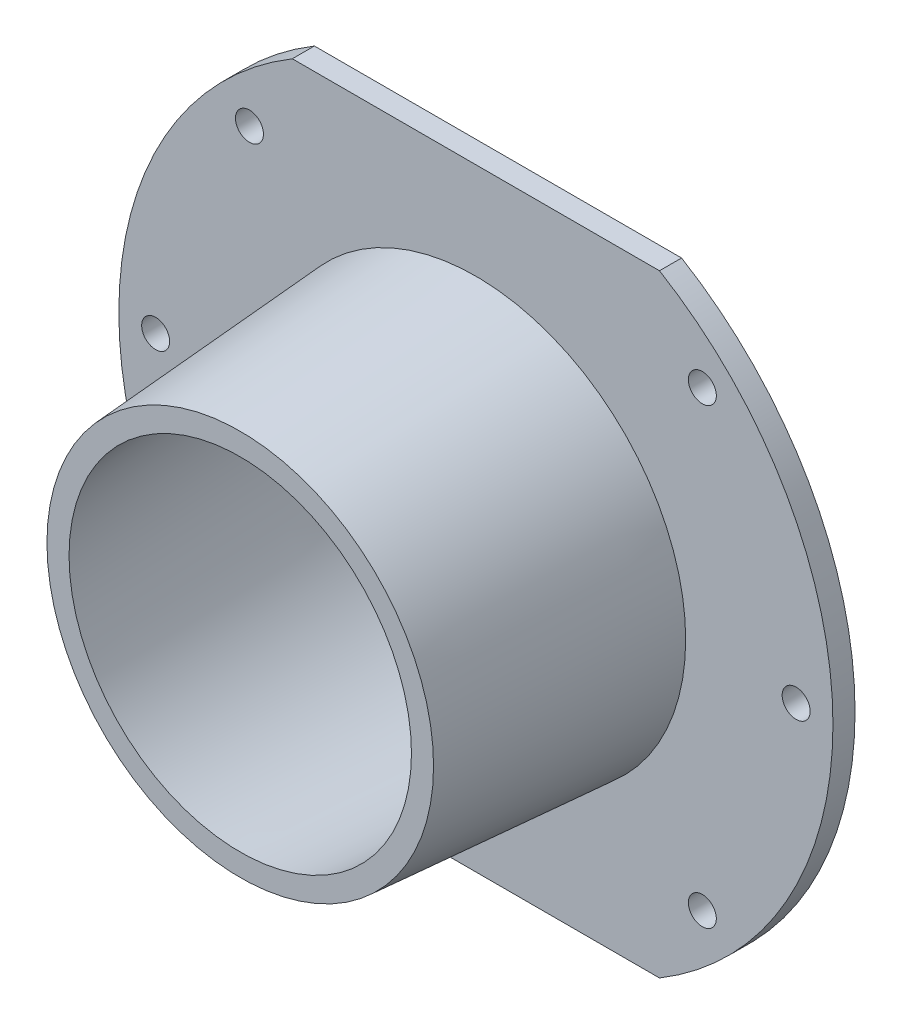
ISO-10303-21;
HEADER;
FILE_DESCRIPTION(('STEP AP214'),'2;1');
FILE_NAME('part.step','',(''),(''),'','','');
FILE_SCHEMA(('AUTOMOTIVE_DESIGN { 1 0 10303 214 1 1 1 1 }'));
ENDSEC;
DATA;
#1=APPLICATION_CONTEXT('core data for automotive mechanical design processes');
#2=APPLICATION_PROTOCOL_DEFINITION('international standard','automotive_design',2000,#1);
#3=PRODUCT_CONTEXT('',#1,'mechanical');
#4=PRODUCT('Part','Part','',(#3));
#5=PRODUCT_RELATED_PRODUCT_CATEGORY('part','',(#4));
#6=PRODUCT_DEFINITION_FORMATION('','',#4);
#7=PRODUCT_DEFINITION_CONTEXT('part definition',#1,'design');
#8=PRODUCT_DEFINITION('design','',#6,#7);
#9=PRODUCT_DEFINITION_SHAPE('','',#8);
#10=(LENGTH_UNIT() NAMED_UNIT(*) SI_UNIT(.MILLI.,.METRE.));
#11=(NAMED_UNIT(*) PLANE_ANGLE_UNIT() SI_UNIT($,.RADIAN.));
#12=(NAMED_UNIT(*) SI_UNIT($,.STERADIAN.) SOLID_ANGLE_UNIT());
#13=UNCERTAINTY_MEASURE_WITH_UNIT(LENGTH_MEASURE(1.E-05),#10,'distance_accuracy_value','');
#14=(GEOMETRIC_REPRESENTATION_CONTEXT(3) GLOBAL_UNCERTAINTY_ASSIGNED_CONTEXT((#13)) GLOBAL_UNIT_ASSIGNED_CONTEXT((#10,
#11,#12)) REPRESENTATION_CONTEXT('',''));
#15=CARTESIAN_POINT('',(0.,0.,0.));
#16=DIRECTION('',(0.,0.,1.));
#17=DIRECTION('',(1.,0.,0.));
#18=AXIS2_PLACEMENT_3D('',#15,#16,#17);
#19=CARTESIAN_POINT('',(0.,0.,-35.));
#20=DIRECTION('',(0.,0.,1.));
#21=DIRECTION('',(1.,0.,0.));
#22=AXIS2_PLACEMENT_3D('',#19,#20,#21);
#23=PLANE('',#22);
#24=CARTESIAN_POINT('',(-30.7504178571297,-30.7504178571293,-35.));
#25=DIRECTION('',(0.,0.,1.));
#26=DIRECTION('',(-0.707106781186551,-0.707106781186544,0.));
#27=AXIS2_PLACEMENT_3D('',#24,#25,#26);
#28=CIRCLE('',#27,1.9);
#29=CARTESIAN_POINT('',(-32.0939207413841,-32.0939207413838,-35.));
#30=VERTEX_POINT('',#29);
#31=EDGE_CURVE('E123',#30,#30,#28,.T.);
#32=ORIENTED_EDGE('',*,*,#31,.T.);
#33=EDGE_LOOP('',(#32));
#34=FACE_BOUND('',#33,.T.);
#35=CARTESIAN_POINT('',(-43.4876579821923,0.,-35.));
#36=DIRECTION('',(0.,0.,1.));
#37=DIRECTION('',(-1.,0.,0.));
#38=AXIS2_PLACEMENT_3D('',#35,#36,#37);
#39=CIRCLE('',#38,1.9);
#40=CARTESIAN_POINT('',(-45.3876579821923,0.,-35.));
#41=VERTEX_POINT('',#40);
#42=EDGE_CURVE('E130',#41,#41,#39,.T.);
#43=ORIENTED_EDGE('',*,*,#42,.T.);
#44=EDGE_LOOP('',(#43));
#45=FACE_BOUND('',#44,.T.);
#46=CARTESIAN_POINT('',(-30.7504178571292,30.7504178571298,-35.));
#47=DIRECTION('',(0.,0.,1.));
#48=DIRECTION('',(-0.707106781186541,0.707106781186554,0.));
#49=AXIS2_PLACEMENT_3D('',#46,#47,#48);
#50=CIRCLE('',#49,1.9);
#51=CARTESIAN_POINT('',(-32.0939207413837,32.0939207413842,-35.));
#52=VERTEX_POINT('',#51);
#53=EDGE_CURVE('E136',#52,#52,#50,.T.);
#54=ORIENTED_EDGE('',*,*,#53,.T.);
#55=EDGE_LOOP('',(#54));
#56=FACE_BOUND('',#55,.T.);
#57=CARTESIAN_POINT('',(30.7504178571299,30.7504178571291,-35.));
#58=DIRECTION('',(0.,0.,1.));
#59=DIRECTION('',(0.707106781186556,0.707106781186539,0.));
#60=AXIS2_PLACEMENT_3D('',#57,#58,#59);
#61=CIRCLE('',#60,1.9);
#62=CARTESIAN_POINT('',(32.0939207413843,32.0939207413835,-35.));
#63=VERTEX_POINT('',#62);
#64=EDGE_CURVE('E117',#63,#63,#61,.T.);
#65=ORIENTED_EDGE('',*,*,#64,.T.);
#66=EDGE_LOOP('',(#65));
#67=FACE_BOUND('',#66,.T.);
#68=CARTESIAN_POINT('',(30.7504178571294,-30.7504178571296,-35.));
#69=DIRECTION('',(0.,0.,1.));
#70=DIRECTION('',(0.707106781186546,-0.707106781186549,0.));
#71=AXIS2_PLACEMENT_3D('',#68,#69,#70);
#72=CIRCLE('',#71,1.9);
#73=CARTESIAN_POINT('',(32.0939207413839,-32.093920741384,-35.));
#74=VERTEX_POINT('',#73);
#75=EDGE_CURVE('E141',#74,#74,#72,.T.);
#76=ORIENTED_EDGE('',*,*,#75,.T.);
#77=EDGE_LOOP('',(#76));
#78=FACE_BOUND('',#77,.T.);
#79=CARTESIAN_POINT('',(43.4876579821923,0.,-35.));
#80=DIRECTION('',(0.,0.,1.));
#81=DIRECTION('',(1.,0.,0.));
#82=AXIS2_PLACEMENT_3D('',#79,#80,#81);
#83=CIRCLE('',#82,1.9);
#84=CARTESIAN_POINT('',(45.3876579821923,0.,-35.));
#85=VERTEX_POINT('',#84);
#86=EDGE_CURVE('E147',#85,#85,#83,.T.);
#87=ORIENTED_EDGE('',*,*,#86,.T.);
#88=EDGE_LOOP('',(#87));
#89=FACE_BOUND('',#88,.T.);
#90=CARTESIAN_POINT('',(0.,0.,-35.));
#91=DIRECTION('',(0.,0.,1.));
#92=DIRECTION('',(1.,0.,0.));
#93=AXIS2_PLACEMENT_3D('',#90,#91,#92);
#94=CIRCLE('',#93,25.6974384180229);
#95=CARTESIAN_POINT('',(25.6974384180229,0.,-35.));
#96=VERTEX_POINT('',#95);
#97=EDGE_CURVE('E157',#96,#96,#94,.T.);
#98=ORIENTED_EDGE('',*,*,#97,.T.);
#99=EDGE_LOOP('',(#98));
#100=FACE_BOUND('',#99,.T.);
#101=DIRECTION('',(1.,0.,0.));
#102=VECTOR('',#101,1.);
#103=CARTESIAN_POINT('',(-48.4876579821923,-41.5876579821923,-35.));
#104=LINE('',#103,#102);
#105=CARTESIAN_POINT('',(-24.9302964313354,-41.5876579821923,-35.));
#106=VERTEX_POINT('',#105);
#107=CARTESIAN_POINT('',(24.9302964313354,-41.5876579821923,-35.));
#108=VERTEX_POINT('',#107);
#109=EDGE_CURVE('E107',#106,#108,#104,.T.);
#110=ORIENTED_EDGE('',*,*,#109,.F.);
#111=CARTESIAN_POINT('',(0.,0.,-35.));
#112=DIRECTION('',(0.,0.,1.));
#113=DIRECTION('',(1.,0.,0.));
#114=AXIS2_PLACEMENT_3D('',#111,#112,#113);
#115=CIRCLE('',#114,48.4876579821923);
#116=CARTESIAN_POINT('',(-24.9302964313354,41.5876579821923,-35.));
#117=VERTEX_POINT('',#116);
#118=EDGE_CURVE('E106',#117,#106,#115,.T.);
#119=ORIENTED_EDGE('',*,*,#118,.F.);
#120=DIRECTION('',(-1.,0.,0.));
#121=VECTOR('',#120,1.);
#122=CARTESIAN_POINT('',(-48.4876579821923,41.5876579821923,-35.));
#123=LINE('',#122,#121);
#124=CARTESIAN_POINT('',(24.9302964313354,41.5876579821923,-35.));
#125=VERTEX_POINT('',#124);
#126=EDGE_CURVE('E58',#125,#117,#123,.T.);
#127=ORIENTED_EDGE('',*,*,#126,.F.);
#128=EDGE_CURVE('E154',#108,#125,#115,.T.);
#129=ORIENTED_EDGE('',*,*,#128,.F.);
#130=EDGE_LOOP('',(#110,#119,#127,#129));
#131=FACE_BOUND('',#130,.T.);
#132=ADVANCED_FACE('F43',(#34,#45,#56,#67,#78,#89,#100,#131),#23,.F.);
#133=CARTESIAN_POINT('',(0.,0.,0.));
#134=DIRECTION('',(0.,0.,1.));
#135=DIRECTION('',(1.,0.,0.));
#136=AXIS2_PLACEMENT_3D('',#133,#134,#135);
#137=CYLINDRICAL_SURFACE('',#136,48.4876579821923);
#138=DIRECTION('',(0.,0.,1.));
#139=VECTOR('',#138,1.);
#140=CARTESIAN_POINT('',(24.9302964313354,-41.5876579821923,0.));
#141=LINE('',#140,#139);
#142=CARTESIAN_POINT('',(24.9302964313354,-41.5876579821923,-32.));
#143=VERTEX_POINT('',#142);
#144=EDGE_CURVE('E102',#108,#143,#141,.T.);
#145=ORIENTED_EDGE('',*,*,#144,.F.);
#146=ORIENTED_EDGE('',*,*,#128,.T.);
#147=DIRECTION('',(0.,0.,1.));
#148=VECTOR('',#147,1.);
#149=CARTESIAN_POINT('',(24.9302964313354,41.5876579821923,0.));
#150=LINE('',#149,#148);
#151=CARTESIAN_POINT('',(24.9302964313354,41.5876579821923,-32.));
#152=VERTEX_POINT('',#151);
#153=EDGE_CURVE('E63',#152,#125,#150,.F.);
#154=ORIENTED_EDGE('',*,*,#153,.F.);
#155=CARTESIAN_POINT('',(0.,0.,-32.));
#156=DIRECTION('',(0.,0.,1.));
#157=DIRECTION('',(1.,0.,0.));
#158=AXIS2_PLACEMENT_3D('',#155,#156,#157);
#159=CIRCLE('',#158,48.4876579821923);
#160=EDGE_CURVE('E91',#143,#152,#159,.T.);
#161=ORIENTED_EDGE('',*,*,#160,.F.);
#162=EDGE_LOOP('',(#145,#146,#154,#161));
#163=FACE_BOUND('',#162,.T.);
#164=ADVANCED_FACE('F179',(#163),#137,.T.);
#165=ORIENTED_EDGE('',*,*,#118,.T.);
#166=DIRECTION('',(0.,0.,1.));
#167=VECTOR('',#166,1.);
#168=CARTESIAN_POINT('',(-24.9302964313354,-41.5876579821923,0.));
#169=LINE('',#168,#167);
#170=CARTESIAN_POINT('',(-24.9302964313354,-41.5876579821923,-32.));
#171=VERTEX_POINT('',#170);
#172=EDGE_CURVE('E99',#171,#106,#169,.F.);
#173=ORIENTED_EDGE('',*,*,#172,.F.);
#174=CARTESIAN_POINT('',(-24.9302964313354,41.5876579821923,-32.));
#175=VERTEX_POINT('',#174);
#176=EDGE_CURVE('E83',#175,#171,#159,.T.);
#177=ORIENTED_EDGE('',*,*,#176,.F.);
#178=DIRECTION('',(0.,0.,1.));
#179=VECTOR('',#178,1.);
#180=CARTESIAN_POINT('',(-24.9302964313354,41.5876579821923,0.));
#181=LINE('',#180,#179);
#182=EDGE_CURVE('E114',#117,#175,#181,.T.);
#183=ORIENTED_EDGE('',*,*,#182,.F.);
#184=EDGE_LOOP('',(#165,#173,#177,#183));
#185=FACE_BOUND('',#184,.T.);
#186=ADVANCED_FACE('F104',(#185),#137,.T.);
#187=CARTESIAN_POINT('',(0.,0.,-32.));
#188=DIRECTION('',(0.,0.,-1.));
#189=DIRECTION('',(-1.,0.,0.));
#190=AXIS2_PLACEMENT_3D('',#187,#188,#189);
#191=PLANE('',#190);
#192=CARTESIAN_POINT('',(-30.7504178571297,-30.7504178571293,-32.));
#193=DIRECTION('',(0.,0.,1.));
#194=DIRECTION('',(-0.707106781186551,-0.707106781186544,0.));
#195=AXIS2_PLACEMENT_3D('',#192,#193,#194);
#196=CIRCLE('',#195,1.9);
#197=CARTESIAN_POINT('',(-32.0939207413841,-32.0939207413838,-32.));
#198=VERTEX_POINT('',#197);
#199=EDGE_CURVE('E127',#198,#198,#196,.T.);
#200=ORIENTED_EDGE('',*,*,#199,.F.);
#201=EDGE_LOOP('',(#200));
#202=FACE_BOUND('',#201,.T.);
#203=CARTESIAN_POINT('',(-43.4876579821923,0.,-32.));
#204=DIRECTION('',(0.,0.,1.));
#205=DIRECTION('',(-1.,0.,0.));
#206=AXIS2_PLACEMENT_3D('',#203,#204,#205);
#207=CIRCLE('',#206,1.9);
#208=CARTESIAN_POINT('',(-45.3876579821923,0.,-32.));
#209=VERTEX_POINT('',#208);
#210=EDGE_CURVE('E133',#209,#209,#207,.T.);
#211=ORIENTED_EDGE('',*,*,#210,.F.);
#212=EDGE_LOOP('',(#211));
#213=FACE_BOUND('',#212,.T.);
#214=CARTESIAN_POINT('',(-30.7504178571292,30.7504178571298,-32.));
#215=DIRECTION('',(0.,0.,1.));
#216=DIRECTION('',(-0.707106781186541,0.707106781186554,0.));
#217=AXIS2_PLACEMENT_3D('',#214,#215,#216);
#218=CIRCLE('',#217,1.9);
#219=CARTESIAN_POINT('',(-32.0939207413837,32.0939207413842,-32.));
#220=VERTEX_POINT('',#219);
#221=EDGE_CURVE('E120',#220,#220,#218,.T.);
#222=ORIENTED_EDGE('',*,*,#221,.F.);
#223=EDGE_LOOP('',(#222));
#224=FACE_BOUND('',#223,.T.);
#225=CARTESIAN_POINT('',(30.7504178571299,30.7504178571291,-32.));
#226=DIRECTION('',(0.,0.,1.));
#227=DIRECTION('',(0.707106781186556,0.707106781186539,0.));
#228=AXIS2_PLACEMENT_3D('',#225,#226,#227);
#229=CIRCLE('',#228,1.9);
#230=CARTESIAN_POINT('',(32.0939207413843,32.0939207413835,-32.));
#231=VERTEX_POINT('',#230);
#232=EDGE_CURVE('E116',#231,#231,#229,.T.);
#233=ORIENTED_EDGE('',*,*,#232,.F.);
#234=EDGE_LOOP('',(#233));
#235=FACE_BOUND('',#234,.T.);
#236=CARTESIAN_POINT('',(30.7504178571294,-30.7504178571296,-32.));
#237=DIRECTION('',(0.,0.,1.));
#238=DIRECTION('',(0.707106781186546,-0.707106781186549,0.));
#239=AXIS2_PLACEMENT_3D('',#236,#237,#238);
#240=CIRCLE('',#239,1.9);
#241=CARTESIAN_POINT('',(32.0939207413839,-32.093920741384,-32.));
#242=VERTEX_POINT('',#241);
#243=EDGE_CURVE('E126',#242,#242,#240,.T.);
#244=ORIENTED_EDGE('',*,*,#243,.F.);
#245=EDGE_LOOP('',(#244));
#246=FACE_BOUND('',#245,.T.);
#247=CARTESIAN_POINT('',(43.4876579821923,0.,-32.));
#248=DIRECTION('',(0.,0.,1.));
#249=DIRECTION('',(1.,0.,0.));
#250=AXIS2_PLACEMENT_3D('',#247,#248,#249);
#251=CIRCLE('',#250,1.9);
#252=CARTESIAN_POINT('',(45.3876579821923,0.,-32.));
#253=VERTEX_POINT('',#252);
#254=EDGE_CURVE('E144',#253,#253,#251,.T.);
#255=ORIENTED_EDGE('',*,*,#254,.F.);
#256=EDGE_LOOP('',(#255));
#257=FACE_BOUND('',#256,.T.);
#258=CARTESIAN_POINT('',(0.,0.,-32.));
#259=DIRECTION('',(0.,0.,1.));
#260=DIRECTION('',(1.,0.,0.));
#261=AXIS2_PLACEMENT_3D('',#258,#259,#260);
#262=CIRCLE('',#261,28.4876579821923);
#263=CARTESIAN_POINT('',(28.4876579821923,0.,-32.));
#264=VERTEX_POINT('',#263);
#265=EDGE_CURVE('E92',#264,#264,#262,.T.);
#266=ORIENTED_EDGE('',*,*,#265,.F.);
#267=EDGE_LOOP('',(#266));
#268=FACE_BOUND('',#267,.T.);
#269=DIRECTION('',(1.,0.,0.));
#270=VECTOR('',#269,1.);
#271=CARTESIAN_POINT('',(-48.4876579821923,-41.5876579821923,-32.));
#272=LINE('',#271,#270);
#273=EDGE_CURVE('E87',#171,#143,#272,.T.);
#274=ORIENTED_EDGE('',*,*,#273,.T.);
#275=ORIENTED_EDGE('',*,*,#160,.T.);
#276=DIRECTION('',(-1.,0.,0.));
#277=VECTOR('',#276,1.);
#278=CARTESIAN_POINT('',(-48.4876579821923,41.5876579821923,-32.));
#279=LINE('',#278,#277);
#280=EDGE_CURVE('E88',#152,#175,#279,.T.);
#281=ORIENTED_EDGE('',*,*,#280,.T.);
#282=ORIENTED_EDGE('',*,*,#176,.T.);
#283=EDGE_LOOP('',(#274,#275,#281,#282));
#284=FACE_BOUND('',#283,.T.);
#285=ADVANCED_FACE('F85',(#202,#213,#224,#235,#246,#257,#268,#284),#191,.F.);
#286=CARTESIAN_POINT('',(0.,0.,-32.));
#287=DIRECTION('',(0.,0.,-1.));
#288=DIRECTION('',(-1.,0.,0.));
#289=AXIS2_PLACEMENT_3D('',#286,#287,#288);
#290=CONICAL_SURFACE('',#289,28.4876579821923,0.0698131700797738);
#291=CARTESIAN_POINT('',(0.,0.,0.));
#292=DIRECTION('',(0.,0.,1.));
#293=DIRECTION('',(1.,0.,0.));
#294=AXIS2_PLACEMENT_3D('',#291,#292,#293);
#295=CIRCLE('',#294,26.25);
#296=CARTESIAN_POINT('',(26.25,0.,0.));
#297=VERTEX_POINT('',#296);
#298=EDGE_CURVE('E11',#297,#297,#295,.T.);
#299=ORIENTED_EDGE('',*,*,#298,.F.);
#300=EDGE_LOOP('',(#299));
#301=FACE_BOUND('',#300,.T.);
#302=ORIENTED_EDGE('',*,*,#265,.T.);
#303=EDGE_LOOP('',(#302));
#304=FACE_BOUND('',#303,.T.);
#305=ADVANCED_FACE('F45',(#301,#304),#290,.T.);
#306=CARTESIAN_POINT('',(0.,0.,0.));
#307=DIRECTION('',(0.,0.,-1.));
#308=DIRECTION('',(-1.,0.,0.));
#309=AXIS2_PLACEMENT_3D('',#306,#307,#308);
#310=PLANE('',#309);
#311=CARTESIAN_POINT('',(0.,0.,0.));
#312=DIRECTION('',(0.,0.,1.));
#313=DIRECTION('',(1.,0.,0.));
#314=AXIS2_PLACEMENT_3D('',#311,#312,#313);
#315=CIRCLE('',#314,23.25);
#316=CARTESIAN_POINT('',(23.25,0.,0.));
#317=VERTEX_POINT('',#316);
#318=EDGE_CURVE('E51',#317,#317,#315,.T.);
#319=ORIENTED_EDGE('',*,*,#318,.F.);
#320=EDGE_LOOP('',(#319));
#321=FACE_BOUND('',#320,.T.);
#322=ORIENTED_EDGE('',*,*,#298,.T.);
#323=EDGE_LOOP('',(#322));
#324=FACE_BOUND('',#323,.T.);
#325=ADVANCED_FACE('F164',(#321,#324),#310,.F.);
#326=CARTESIAN_POINT('',(0.,0.,0.));
#327=DIRECTION('',(0.,0.,-1.));
#328=DIRECTION('',(-1.,0.,0.));
#329=AXIS2_PLACEMENT_3D('',#326,#327,#328);
#330=CONICAL_SURFACE('',#329,23.25,0.0698131700797736);
#331=ORIENTED_EDGE('',*,*,#97,.F.);
#332=EDGE_LOOP('',(#331));
#333=FACE_BOUND('',#332,.T.);
#334=ORIENTED_EDGE('',*,*,#318,.T.);
#335=EDGE_LOOP('',(#334));
#336=FACE_BOUND('',#335,.T.);
#337=ADVANCED_FACE('F162',(#333,#336),#330,.F.);
#338=CARTESIAN_POINT('',(43.4876579821923,0.,-35.));
#339=DIRECTION('',(0.,0.,1.));
#340=DIRECTION('',(1.,0.,0.));
#341=AXIS2_PLACEMENT_3D('',#338,#339,#340);
#342=CYLINDRICAL_SURFACE('',#341,1.9);
#343=ORIENTED_EDGE('',*,*,#86,.F.);
#344=EDGE_LOOP('',(#343));
#345=FACE_BOUND('',#344,.T.);
#346=ORIENTED_EDGE('',*,*,#254,.T.);
#347=EDGE_LOOP('',(#346));
#348=FACE_BOUND('',#347,.T.);
#349=ADVANCED_FACE('F194',(#345,#348),#342,.F.);
#350=CARTESIAN_POINT('',(30.7504178571294,-30.7504178571296,-35.));
#351=DIRECTION('',(0.,0.,1.));
#352=DIRECTION('',(1.,0.,0.));
#353=AXIS2_PLACEMENT_3D('',#350,#351,#352);
#354=CYLINDRICAL_SURFACE('',#353,1.9);
#355=ORIENTED_EDGE('',*,*,#75,.F.);
#356=EDGE_LOOP('',(#355));
#357=FACE_BOUND('',#356,.T.);
#358=ORIENTED_EDGE('',*,*,#243,.T.);
#359=EDGE_LOOP('',(#358));
#360=FACE_BOUND('',#359,.T.);
#361=ADVANCED_FACE('F199',(#357,#360),#354,.F.);
#362=CARTESIAN_POINT('',(30.7504178571299,30.7504178571291,-35.));
#363=DIRECTION('',(0.,0.,1.));
#364=DIRECTION('',(1.,0.,0.));
#365=AXIS2_PLACEMENT_3D('',#362,#363,#364);
#366=CYLINDRICAL_SURFACE('',#365,1.9);
#367=ORIENTED_EDGE('',*,*,#64,.F.);
#368=EDGE_LOOP('',(#367));
#369=FACE_BOUND('',#368,.T.);
#370=ORIENTED_EDGE('',*,*,#232,.T.);
#371=EDGE_LOOP('',(#370));
#372=FACE_BOUND('',#371,.T.);
#373=ADVANCED_FACE('F208',(#369,#372),#366,.F.);
#374=CARTESIAN_POINT('',(-30.7504178571292,30.7504178571298,-35.));
#375=DIRECTION('',(0.,0.,1.));
#376=DIRECTION('',(1.,0.,0.));
#377=AXIS2_PLACEMENT_3D('',#374,#375,#376);
#378=CYLINDRICAL_SURFACE('',#377,1.9);
#379=ORIENTED_EDGE('',*,*,#53,.F.);
#380=EDGE_LOOP('',(#379));
#381=FACE_BOUND('',#380,.T.);
#382=ORIENTED_EDGE('',*,*,#221,.T.);
#383=EDGE_LOOP('',(#382));
#384=FACE_BOUND('',#383,.T.);
#385=ADVANCED_FACE('F214',(#381,#384),#378,.F.);
#386=CARTESIAN_POINT('',(-43.4876579821923,0.,-35.));
#387=DIRECTION('',(0.,0.,1.));
#388=DIRECTION('',(1.,0.,0.));
#389=AXIS2_PLACEMENT_3D('',#386,#387,#388);
#390=CYLINDRICAL_SURFACE('',#389,1.9);
#391=ORIENTED_EDGE('',*,*,#42,.F.);
#392=EDGE_LOOP('',(#391));
#393=FACE_BOUND('',#392,.T.);
#394=ORIENTED_EDGE('',*,*,#210,.T.);
#395=EDGE_LOOP('',(#394));
#396=FACE_BOUND('',#395,.T.);
#397=ADVANCED_FACE('F217',(#393,#396),#390,.F.);
#398=CARTESIAN_POINT('',(-30.7504178571297,-30.7504178571293,-35.));
#399=DIRECTION('',(0.,0.,1.));
#400=DIRECTION('',(1.,0.,0.));
#401=AXIS2_PLACEMENT_3D('',#398,#399,#400);
#402=CYLINDRICAL_SURFACE('',#401,1.9);
#403=ORIENTED_EDGE('',*,*,#31,.F.);
#404=EDGE_LOOP('',(#403));
#405=FACE_BOUND('',#404,.T.);
#406=ORIENTED_EDGE('',*,*,#199,.T.);
#407=EDGE_LOOP('',(#406));
#408=FACE_BOUND('',#407,.T.);
#409=ADVANCED_FACE('F221',(#405,#408),#402,.F.);
#410=CARTESIAN_POINT('',(-48.4876579821923,41.5876579821923,-35.));
#411=DIRECTION('',(0.,1.,0.));
#412=DIRECTION('',(0.,0.,1.));
#413=AXIS2_PLACEMENT_3D('',#410,#411,#412);
#414=PLANE('',#413);
#415=ORIENTED_EDGE('',*,*,#182,.T.);
#416=ORIENTED_EDGE('',*,*,#280,.F.);
#417=ORIENTED_EDGE('',*,*,#153,.T.);
#418=ORIENTED_EDGE('',*,*,#126,.T.);
#419=EDGE_LOOP('',(#415,#416,#417,#418));
#420=FACE_BOUND('',#419,.T.);
#421=ADVANCED_FACE('F225',(#420),#414,.T.);
#422=CARTESIAN_POINT('',(-48.4876579821923,-41.5876579821923,-35.));
#423=DIRECTION('',(0.,-1.,0.));
#424=DIRECTION('',(0.,0.,-1.));
#425=AXIS2_PLACEMENT_3D('',#422,#423,#424);
#426=PLANE('',#425);
#427=ORIENTED_EDGE('',*,*,#144,.T.);
#428=ORIENTED_EDGE('',*,*,#273,.F.);
#429=ORIENTED_EDGE('',*,*,#172,.T.);
#430=ORIENTED_EDGE('',*,*,#109,.T.);
#431=EDGE_LOOP('',(#427,#428,#429,#430));
#432=FACE_BOUND('',#431,.T.);
#433=ADVANCED_FACE('F97',(#432),#426,.T.);
#434=CLOSED_SHELL('',(#132,#164,#186,#285,#305,#325,#337,#349,#361,#373,#385,#397,#409,#421,#433));
#435=MANIFOLD_SOLID_BREP('B2',#434);
#436=ADVANCED_BREP_SHAPE_REPRESENTATION('',(#18,#435),#14);
#437=SHAPE_DEFINITION_REPRESENTATION(#9,#436);
ENDSEC;
END-ISO-10303-21;
